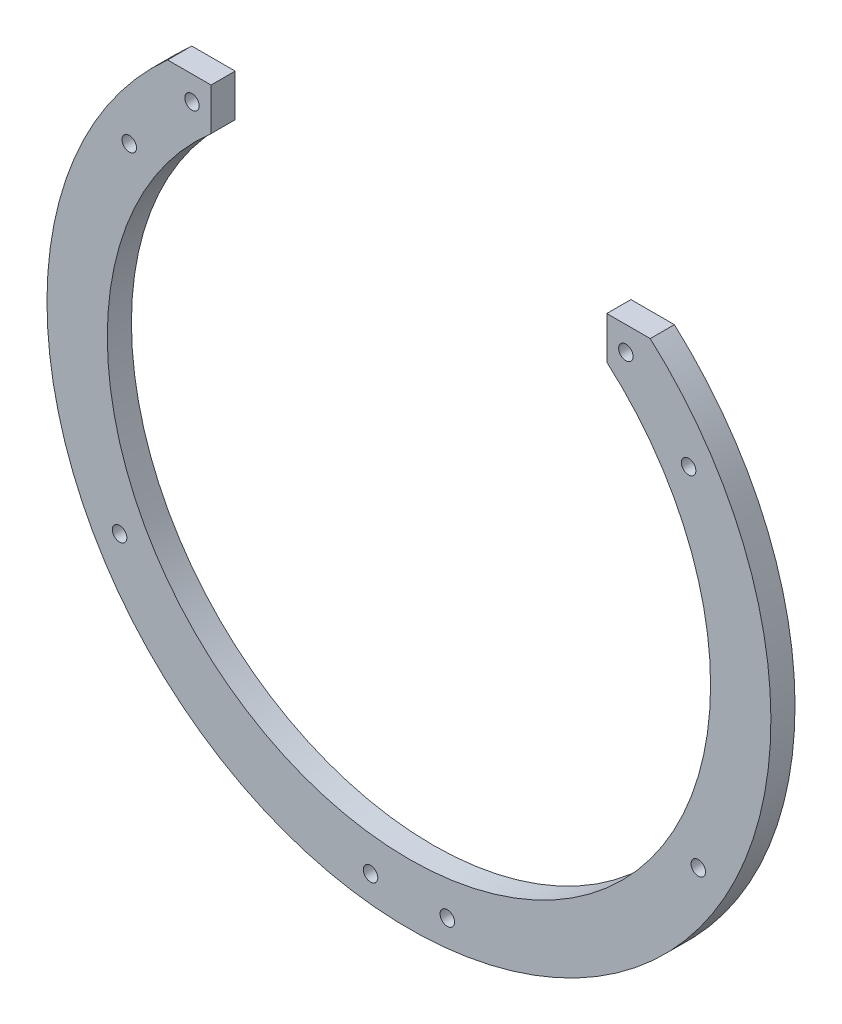
ISO-10303-21;
HEADER;
FILE_DESCRIPTION(('STEP AP214'),'2;1');
FILE_NAME('part.step','',(''),(''),'','','');
FILE_SCHEMA(('AUTOMOTIVE_DESIGN { 1 0 10303 214 1 1 1 1 }'));
ENDSEC;
DATA;
#1=APPLICATION_CONTEXT('core data for automotive mechanical design processes');
#2=APPLICATION_PROTOCOL_DEFINITION('international standard','automotive_design',2000,#1);
#3=PRODUCT_CONTEXT('',#1,'mechanical');
#4=PRODUCT('Part','Part','',(#3));
#5=PRODUCT_RELATED_PRODUCT_CATEGORY('part','',(#4));
#6=PRODUCT_DEFINITION_FORMATION('','',#4);
#7=PRODUCT_DEFINITION_CONTEXT('part definition',#1,'design');
#8=PRODUCT_DEFINITION('design','',#6,#7);
#9=PRODUCT_DEFINITION_SHAPE('','',#8);
#10=(LENGTH_UNIT() NAMED_UNIT(*) SI_UNIT(.MILLI.,.METRE.));
#11=(NAMED_UNIT(*) PLANE_ANGLE_UNIT() SI_UNIT($,.RADIAN.));
#12=(NAMED_UNIT(*) SI_UNIT($,.STERADIAN.) SOLID_ANGLE_UNIT());
#13=UNCERTAINTY_MEASURE_WITH_UNIT(LENGTH_MEASURE(1.E-05),#10,'distance_accuracy_value','');
#14=(GEOMETRIC_REPRESENTATION_CONTEXT(3) GLOBAL_UNCERTAINTY_ASSIGNED_CONTEXT((#13)) GLOBAL_UNIT_ASSIGNED_CONTEXT((#10,
#11,#12)) REPRESENTATION_CONTEXT('',''));
#15=CARTESIAN_POINT('',(0.,0.,0.));
#16=DIRECTION('',(0.,0.,1.));
#17=DIRECTION('',(1.,0.,0.));
#18=AXIS2_PLACEMENT_3D('',#15,#16,#17);
#19=CARTESIAN_POINT('',(-5.50459453888519,-224.332190762557,5.));
#20=DIRECTION('',(0.,0.,-1.));
#21=DIRECTION('',(-1.,0.,0.));
#22=AXIS2_PLACEMENT_3D('',#19,#20,#21);
#23=CYLINDRICAL_SURFACE('',#22,62.5);
#24=DIRECTION('',(0.,0.,-1.));
#25=VECTOR('',#24,1.);
#26=CARTESIAN_POINT('',(35.4954054611148,-177.159635182008,5.));
#27=LINE('',#26,#25);
#28=CARTESIAN_POINT('',(35.4954054611148,-177.159635182008,0.));
#29=VERTEX_POINT('',#28);
#30=CARTESIAN_POINT('',(35.4954054611148,-177.159635182008,5.));
#31=VERTEX_POINT('',#30);
#32=EDGE_CURVE('E137',#29,#31,#27,.F.);
#33=ORIENTED_EDGE('',*,*,#32,.F.);
#34=CARTESIAN_POINT('',(-5.50459453888519,-224.332190762557,0.));
#35=DIRECTION('',(0.,0.,1.));
#36=DIRECTION('',(1.,0.,0.));
#37=AXIS2_PLACEMENT_3D('',#34,#35,#36);
#38=CIRCLE('',#37,62.5);
#39=CARTESIAN_POINT('',(-46.5045945388852,-177.159635182008,0.));
#40=VERTEX_POINT('',#39);
#41=EDGE_CURVE('E119',#40,#29,#38,.T.);
#42=ORIENTED_EDGE('',*,*,#41,.F.);
#43=DIRECTION('',(0.,0.,-1.));
#44=VECTOR('',#43,1.);
#45=CARTESIAN_POINT('',(-46.5045945388852,-177.159635182008,5.));
#46=LINE('',#45,#44);
#47=CARTESIAN_POINT('',(-46.5045945388852,-177.159635182008,5.));
#48=VERTEX_POINT('',#47);
#49=EDGE_CURVE('E57',#48,#40,#46,.T.);
#50=ORIENTED_EDGE('',*,*,#49,.F.);
#51=CARTESIAN_POINT('',(-5.50459453888519,-224.332190762557,5.));
#52=DIRECTION('',(0.,0.,1.));
#53=DIRECTION('',(1.,0.,0.));
#54=AXIS2_PLACEMENT_3D('',#51,#52,#53);
#55=CIRCLE('',#54,62.5);
#56=EDGE_CURVE('E101',#48,#31,#55,.T.);
#57=ORIENTED_EDGE('',*,*,#56,.T.);
#58=EDGE_LOOP('',(#33,#42,#50,#57));
#59=FACE_BOUND('',#58,.T.);
#60=ADVANCED_FACE('F36',(#59),#23,.F.);
#61=CARTESIAN_POINT('',(0.,-168.430491325062,5.));
#62=DIRECTION('',(0.,-1.,0.));
#63=DIRECTION('',(0.,0.,-1.));
#64=AXIS2_PLACEMENT_3D('',#61,#62,#63);
#65=PLANE('',#64);
#66=DIRECTION('',(-1.,0.,0.));
#67=VECTOR('',#66,1.);
#68=CARTESIAN_POINT('',(0.,-168.430491325062,5.));
#69=LINE('',#68,#67);
#70=CARTESIAN_POINT('',(-46.5045945388852,-168.430491325062,5.));
#71=VERTEX_POINT('',#70);
#72=CARTESIAN_POINT('',(-55.5045945388852,-168.430491325062,5.));
#73=VERTEX_POINT('',#72);
#74=EDGE_CURVE('E98',#71,#73,#69,.T.);
#75=ORIENTED_EDGE('',*,*,#74,.F.);
#76=DIRECTION('',(0.,0.,-1.));
#77=VECTOR('',#76,1.);
#78=CARTESIAN_POINT('',(-46.5045945388852,-168.430491325062,5.));
#79=LINE('',#78,#77);
#80=CARTESIAN_POINT('',(-46.5045945388852,-168.430491325062,0.));
#81=VERTEX_POINT('',#80);
#82=EDGE_CURVE('E85',#71,#81,#79,.T.);
#83=ORIENTED_EDGE('',*,*,#82,.T.);
#84=DIRECTION('',(-1.,0.,0.));
#85=VECTOR('',#84,1.);
#86=CARTESIAN_POINT('',(0.,-168.430491325062,0.));
#87=LINE('',#86,#85);
#88=CARTESIAN_POINT('',(-55.5045945388852,-168.430491325062,0.));
#89=VERTEX_POINT('',#88);
#90=EDGE_CURVE('E122',#81,#89,#87,.T.);
#91=ORIENTED_EDGE('',*,*,#90,.T.);
#92=DIRECTION('',(0.,0.,-1.));
#93=VECTOR('',#92,1.);
#94=CARTESIAN_POINT('',(-55.5045945388852,-168.430491325062,5.));
#95=LINE('',#94,#93);
#96=EDGE_CURVE('E106',#73,#89,#95,.T.);
#97=ORIENTED_EDGE('',*,*,#96,.F.);
#98=EDGE_LOOP('',(#75,#83,#91,#97));
#99=FACE_BOUND('',#98,.T.);
#100=ADVANCED_FACE('F104',(#99),#65,.F.);
#101=CARTESIAN_POINT('',(-5.50459453888519,-224.332190762557,5.));
#102=DIRECTION('',(0.,0.,-1.));
#103=DIRECTION('',(-1.,0.,0.));
#104=AXIS2_PLACEMENT_3D('',#101,#102,#103);
#105=CYLINDRICAL_SURFACE('',#104,75.);
#106=CARTESIAN_POINT('',(-5.50459453888519,-224.332190762557,0.));
#107=DIRECTION('',(0.,0.,1.));
#108=DIRECTION('',(1.,0.,0.));
#109=AXIS2_PLACEMENT_3D('',#106,#107,#108);
#110=CIRCLE('',#109,75.);
#111=CARTESIAN_POINT('',(44.4954054611148,-168.430491325062,0.));
#112=VERTEX_POINT('',#111);
#113=EDGE_CURVE('E125',#89,#112,#110,.T.);
#114=ORIENTED_EDGE('',*,*,#113,.T.);
#115=DIRECTION('',(0.,0.,-1.));
#116=VECTOR('',#115,1.);
#117=CARTESIAN_POINT('',(44.4954054611148,-168.430491325062,5.));
#118=LINE('',#117,#116);
#119=CARTESIAN_POINT('',(44.4954054611148,-168.430491325062,5.));
#120=VERTEX_POINT('',#119);
#121=EDGE_CURVE('E118',#120,#112,#118,.T.);
#122=ORIENTED_EDGE('',*,*,#121,.F.);
#123=CARTESIAN_POINT('',(-5.50459453888519,-224.332190762557,5.));
#124=DIRECTION('',(0.,0.,1.));
#125=DIRECTION('',(1.,0.,0.));
#126=AXIS2_PLACEMENT_3D('',#123,#124,#125);
#127=CIRCLE('',#126,75.);
#128=EDGE_CURVE('E108',#73,#120,#127,.T.);
#129=ORIENTED_EDGE('',*,*,#128,.F.);
#130=ORIENTED_EDGE('',*,*,#96,.T.);
#131=EDGE_LOOP('',(#114,#122,#129,#130));
#132=FACE_BOUND('',#131,.T.);
#133=ADVANCED_FACE('F200',(#132),#105,.T.);
#134=CARTESIAN_POINT('',(0.,-168.430491325062,5.));
#135=DIRECTION('',(0.,-1.,0.));
#136=DIRECTION('',(0.,0.,-1.));
#137=AXIS2_PLACEMENT_3D('',#134,#135,#136);
#138=PLANE('',#137);
#139=DIRECTION('',(-1.,0.,0.));
#140=VECTOR('',#139,1.);
#141=CARTESIAN_POINT('',(0.,-168.430491325062,0.));
#142=LINE('',#141,#140);
#143=CARTESIAN_POINT('',(35.4954054611148,-168.430491325062,0.));
#144=VERTEX_POINT('',#143);
#145=EDGE_CURVE('E112',#112,#144,#142,.T.);
#146=ORIENTED_EDGE('',*,*,#145,.T.);
#147=DIRECTION('',(0.,0.,1.));
#148=VECTOR('',#147,1.);
#149=CARTESIAN_POINT('',(35.4954054611148,-168.430491325062,5.));
#150=LINE('',#149,#148);
#151=CARTESIAN_POINT('',(35.4954054611148,-168.430491325062,5.));
#152=VERTEX_POINT('',#151);
#153=EDGE_CURVE('E50',#144,#152,#150,.T.);
#154=ORIENTED_EDGE('',*,*,#153,.T.);
#155=DIRECTION('',(-1.,0.,0.));
#156=VECTOR('',#155,1.);
#157=CARTESIAN_POINT('',(0.,-168.430491325062,5.));
#158=LINE('',#157,#156);
#159=EDGE_CURVE('E110',#120,#152,#158,.T.);
#160=ORIENTED_EDGE('',*,*,#159,.F.);
#161=ORIENTED_EDGE('',*,*,#121,.T.);
#162=EDGE_LOOP('',(#146,#154,#160,#161));
#163=FACE_BOUND('',#162,.T.);
#164=ADVANCED_FACE('F192',(#163),#138,.F.);
#165=CARTESIAN_POINT('',(0.,0.,5.));
#166=DIRECTION('',(0.,0.,1.));
#167=DIRECTION('',(1.,0.,0.));
#168=AXIS2_PLACEMENT_3D('',#165,#166,#167);
#169=PLANE('',#168);
#170=DIRECTION('',(0.,1.,0.));
#171=VECTOR('',#170,1.);
#172=CARTESIAN_POINT('',(35.4954054611148,-179.941391977075,5.));
#173=LINE('',#172,#171);
#174=EDGE_CURVE('E102',#31,#152,#173,.T.);
#175=ORIENTED_EDGE('',*,*,#174,.F.);
#176=ORIENTED_EDGE('',*,*,#56,.F.);
#177=DIRECTION('',(0.,-1.,0.));
#178=VECTOR('',#177,1.);
#179=CARTESIAN_POINT('',(-46.5045945388852,-179.941391977075,5.));
#180=LINE('',#179,#178);
#181=EDGE_CURVE('E88',#71,#48,#180,.T.);
#182=ORIENTED_EDGE('',*,*,#181,.F.);
#183=ORIENTED_EDGE('',*,*,#74,.T.);
#184=ORIENTED_EDGE('',*,*,#128,.T.);
#185=ORIENTED_EDGE('',*,*,#159,.T.);
#186=EDGE_LOOP('',(#175,#176,#182,#183,#184,#185));
#187=FACE_BOUND('',#186,.T.);
#188=CARTESIAN_POINT('',(-50.4554442576325,-173.430491325062,5.));
#189=DIRECTION('',(0.,0.,1.));
#190=DIRECTION('',(-1.,0.,0.));
#191=AXIS2_PLACEMENT_3D('',#188,#189,#190);
#192=CIRCLE('',#191,1.5);
#193=CARTESIAN_POINT('',(-51.9554442576325,-173.430491325062,5.));
#194=VERTEX_POINT('',#193);
#195=EDGE_CURVE('E138',#194,#194,#192,.T.);
#196=ORIENTED_EDGE('',*,*,#195,.F.);
#197=EDGE_LOOP('',(#196));
#198=FACE_BOUND('',#197,.T.);
#199=CARTESIAN_POINT('',(-63.4554442576325,-187.430491325062,5.));
#200=DIRECTION('',(0.,0.,1.));
#201=DIRECTION('',(-1.,0.,0.));
#202=AXIS2_PLACEMENT_3D('',#199,#200,#201);
#203=CIRCLE('',#202,1.50000000000001);
#204=CARTESIAN_POINT('',(-64.9554442576325,-187.430491325062,5.));
#205=VERTEX_POINT('',#204);
#206=EDGE_CURVE('E162',#205,#205,#203,.T.);
#207=ORIENTED_EDGE('',*,*,#206,.F.);
#208=EDGE_LOOP('',(#207));
#209=FACE_BOUND('',#208,.T.);
#210=CARTESIAN_POINT('',(-65.4554442576326,-258.430491325062,5.));
#211=DIRECTION('',(0.,0.,1.));
#212=DIRECTION('',(-1.,0.,0.));
#213=AXIS2_PLACEMENT_3D('',#210,#211,#212);
#214=CIRCLE('',#213,1.50000000000001);
#215=CARTESIAN_POINT('',(-66.9554442576326,-258.430491325062,5.));
#216=VERTEX_POINT('',#215);
#217=EDGE_CURVE('E156',#216,#216,#214,.T.);
#218=ORIENTED_EDGE('',*,*,#217,.F.);
#219=EDGE_LOOP('',(#218));
#220=FACE_BOUND('',#219,.T.);
#221=CARTESIAN_POINT('',(2.4462551798622,-293.430491325062,5.));
#222=DIRECTION('',(0.,0.,1.));
#223=DIRECTION('',(1.,0.,0.));
#224=AXIS2_PLACEMENT_3D('',#221,#222,#223);
#225=CIRCLE('',#224,1.5);
#226=CARTESIAN_POINT('',(3.9462551798622,-293.430491325062,5.));
#227=VERTEX_POINT('',#226);
#228=EDGE_CURVE('E150',#227,#227,#225,.T.);
#229=ORIENTED_EDGE('',*,*,#228,.F.);
#230=EDGE_LOOP('',(#229));
#231=FACE_BOUND('',#230,.T.);
#232=CARTESIAN_POINT('',(-13.4554442576326,-293.430491325062,5.));
#233=DIRECTION('',(0.,0.,1.));
#234=DIRECTION('',(-1.,0.,0.));
#235=AXIS2_PLACEMENT_3D('',#232,#233,#234);
#236=CIRCLE('',#235,1.5);
#237=CARTESIAN_POINT('',(-14.9554442576326,-293.430491325062,5.));
#238=VERTEX_POINT('',#237);
#239=EDGE_CURVE('E149',#238,#238,#236,.T.);
#240=ORIENTED_EDGE('',*,*,#239,.F.);
#241=EDGE_LOOP('',(#240));
#242=FACE_BOUND('',#241,.T.);
#243=CARTESIAN_POINT('',(54.4462551798622,-258.430491325062,5.));
#244=DIRECTION('',(0.,0.,1.));
#245=DIRECTION('',(1.,0.,0.));
#246=AXIS2_PLACEMENT_3D('',#243,#244,#245);
#247=CIRCLE('',#246,1.5);
#248=CARTESIAN_POINT('',(55.9462551798622,-258.430491325062,5.));
#249=VERTEX_POINT('',#248);
#250=EDGE_CURVE('E177',#249,#249,#247,.T.);
#251=ORIENTED_EDGE('',*,*,#250,.F.);
#252=EDGE_LOOP('',(#251));
#253=FACE_BOUND('',#252,.T.);
#254=CARTESIAN_POINT('',(52.4462551798622,-187.430491325062,5.));
#255=DIRECTION('',(0.,0.,1.));
#256=DIRECTION('',(1.,0.,0.));
#257=AXIS2_PLACEMENT_3D('',#254,#255,#256);
#258=CIRCLE('',#257,1.5);
#259=CARTESIAN_POINT('',(53.9462551798622,-187.430491325062,5.));
#260=VERTEX_POINT('',#259);
#261=EDGE_CURVE('E171',#260,#260,#258,.T.);
#262=ORIENTED_EDGE('',*,*,#261,.F.);
#263=EDGE_LOOP('',(#262));
#264=FACE_BOUND('',#263,.T.);
#265=CARTESIAN_POINT('',(39.4462551798622,-173.430491325062,5.));
#266=DIRECTION('',(0.,0.,1.));
#267=DIRECTION('',(1.,0.,0.));
#268=AXIS2_PLACEMENT_3D('',#265,#266,#267);
#269=CIRCLE('',#268,1.5);
#270=CARTESIAN_POINT('',(40.9462551798622,-173.430491325062,5.));
#271=VERTEX_POINT('',#270);
#272=EDGE_CURVE('E170',#271,#271,#269,.T.);
#273=ORIENTED_EDGE('',*,*,#272,.F.);
#274=EDGE_LOOP('',(#273));
#275=FACE_BOUND('',#274,.T.);
#276=ADVANCED_FACE('F96',(#187,#198,#209,#220,#231,#242,#253,#264,#275),#169,.T.);
#277=CARTESIAN_POINT('',(0.,0.,0.));
#278=DIRECTION('',(0.,0.,1.));
#279=DIRECTION('',(1.,0.,0.));
#280=AXIS2_PLACEMENT_3D('',#277,#278,#279);
#281=PLANE('',#280);
#282=CARTESIAN_POINT('',(-50.4554442576325,-173.430491325062,0.));
#283=DIRECTION('',(0.,0.,1.));
#284=DIRECTION('',(-1.,0.,0.));
#285=AXIS2_PLACEMENT_3D('',#282,#283,#284);
#286=CIRCLE('',#285,1.5);
#287=CARTESIAN_POINT('',(-51.9554442576325,-173.430491325062,0.));
#288=VERTEX_POINT('',#287);
#289=EDGE_CURVE('E141',#288,#288,#286,.T.);
#290=ORIENTED_EDGE('',*,*,#289,.T.);
#291=EDGE_LOOP('',(#290));
#292=FACE_BOUND('',#291,.T.);
#293=CARTESIAN_POINT('',(-63.4554442576325,-187.430491325062,0.));
#294=DIRECTION('',(0.,0.,1.));
#295=DIRECTION('',(-1.,0.,0.));
#296=AXIS2_PLACEMENT_3D('',#293,#294,#295);
#297=CIRCLE('',#296,1.50000000000001);
#298=CARTESIAN_POINT('',(-64.9554442576325,-187.430491325062,0.));
#299=VERTEX_POINT('',#298);
#300=EDGE_CURVE('E159',#299,#299,#297,.T.);
#301=ORIENTED_EDGE('',*,*,#300,.T.);
#302=EDGE_LOOP('',(#301));
#303=FACE_BOUND('',#302,.T.);
#304=CARTESIAN_POINT('',(-65.4554442576326,-258.430491325062,0.));
#305=DIRECTION('',(0.,0.,1.));
#306=DIRECTION('',(-1.,0.,0.));
#307=AXIS2_PLACEMENT_3D('',#304,#305,#306);
#308=CIRCLE('',#307,1.50000000000001);
#309=CARTESIAN_POINT('',(-66.9554442576326,-258.430491325062,0.));
#310=VERTEX_POINT('',#309);
#311=EDGE_CURVE('E153',#310,#310,#308,.T.);
#312=ORIENTED_EDGE('',*,*,#311,.T.);
#313=EDGE_LOOP('',(#312));
#314=FACE_BOUND('',#313,.T.);
#315=CARTESIAN_POINT('',(2.4462551798622,-293.430491325062,0.));
#316=DIRECTION('',(0.,0.,1.));
#317=DIRECTION('',(1.,0.,0.));
#318=AXIS2_PLACEMENT_3D('',#315,#316,#317);
#319=CIRCLE('',#318,1.5);
#320=CARTESIAN_POINT('',(3.9462551798622,-293.430491325062,0.));
#321=VERTEX_POINT('',#320);
#322=EDGE_CURVE('E146',#321,#321,#319,.T.);
#323=ORIENTED_EDGE('',*,*,#322,.T.);
#324=EDGE_LOOP('',(#323));
#325=FACE_BOUND('',#324,.T.);
#326=CARTESIAN_POINT('',(-13.4554442576326,-293.430491325062,0.));
#327=DIRECTION('',(0.,0.,1.));
#328=DIRECTION('',(-1.,0.,0.));
#329=AXIS2_PLACEMENT_3D('',#326,#327,#328);
#330=CIRCLE('',#329,1.5);
#331=CARTESIAN_POINT('',(-14.9554442576326,-293.430491325062,0.));
#332=VERTEX_POINT('',#331);
#333=EDGE_CURVE('E180',#332,#332,#330,.T.);
#334=ORIENTED_EDGE('',*,*,#333,.T.);
#335=EDGE_LOOP('',(#334));
#336=FACE_BOUND('',#335,.T.);
#337=CARTESIAN_POINT('',(54.4462551798622,-258.430491325062,0.));
#338=DIRECTION('',(0.,0.,1.));
#339=DIRECTION('',(1.,0.,0.));
#340=AXIS2_PLACEMENT_3D('',#337,#338,#339);
#341=CIRCLE('',#340,1.5);
#342=CARTESIAN_POINT('',(55.9462551798622,-258.430491325062,0.));
#343=VERTEX_POINT('',#342);
#344=EDGE_CURVE('E174',#343,#343,#341,.T.);
#345=ORIENTED_EDGE('',*,*,#344,.T.);
#346=EDGE_LOOP('',(#345));
#347=FACE_BOUND('',#346,.T.);
#348=CARTESIAN_POINT('',(52.4462551798622,-187.430491325062,0.));
#349=DIRECTION('',(0.,0.,1.));
#350=DIRECTION('',(1.,0.,0.));
#351=AXIS2_PLACEMENT_3D('',#348,#349,#350);
#352=CIRCLE('',#351,1.5);
#353=CARTESIAN_POINT('',(53.9462551798622,-187.430491325062,0.));
#354=VERTEX_POINT('',#353);
#355=EDGE_CURVE('E167',#354,#354,#352,.T.);
#356=ORIENTED_EDGE('',*,*,#355,.T.);
#357=EDGE_LOOP('',(#356));
#358=FACE_BOUND('',#357,.T.);
#359=CARTESIAN_POINT('',(39.4462551798622,-173.430491325062,0.));
#360=DIRECTION('',(0.,0.,1.));
#361=DIRECTION('',(1.,0.,0.));
#362=AXIS2_PLACEMENT_3D('',#359,#360,#361);
#363=CIRCLE('',#362,1.5);
#364=CARTESIAN_POINT('',(40.9462551798622,-173.430491325062,0.));
#365=VERTEX_POINT('',#364);
#366=EDGE_CURVE('E123',#365,#365,#363,.T.);
#367=ORIENTED_EDGE('',*,*,#366,.T.);
#368=EDGE_LOOP('',(#367));
#369=FACE_BOUND('',#368,.T.);
#370=ORIENTED_EDGE('',*,*,#41,.T.);
#371=DIRECTION('',(0.,1.,0.));
#372=VECTOR('',#371,1.);
#373=CARTESIAN_POINT('',(35.4954054611148,0.,0.));
#374=LINE('',#373,#372);
#375=EDGE_CURVE('E11',#29,#144,#374,.T.);
#376=ORIENTED_EDGE('',*,*,#375,.T.);
#377=ORIENTED_EDGE('',*,*,#145,.F.);
#378=ORIENTED_EDGE('',*,*,#113,.F.);
#379=ORIENTED_EDGE('',*,*,#90,.F.);
#380=DIRECTION('',(0.,-1.,0.));
#381=VECTOR('',#380,1.);
#382=CARTESIAN_POINT('',(-46.5045945388852,0.,0.));
#383=LINE('',#382,#381);
#384=EDGE_CURVE('E43',#81,#40,#383,.T.);
#385=ORIENTED_EDGE('',*,*,#384,.T.);
#386=EDGE_LOOP('',(#370,#376,#377,#378,#379,#385));
#387=FACE_BOUND('',#386,.T.);
#388=ADVANCED_FACE('F133',(#292,#303,#314,#325,#336,#347,#358,#369,#387),#281,.F.);
#389=CARTESIAN_POINT('',(39.4462551798622,-173.430491325062,0.));
#390=DIRECTION('',(0.,0.,1.));
#391=DIRECTION('',(1.,0.,0.));
#392=AXIS2_PLACEMENT_3D('',#389,#390,#391);
#393=CYLINDRICAL_SURFACE('',#392,1.5);
#394=ORIENTED_EDGE('',*,*,#366,.F.);
#395=EDGE_LOOP('',(#394));
#396=FACE_BOUND('',#395,.T.);
#397=ORIENTED_EDGE('',*,*,#272,.T.);
#398=EDGE_LOOP('',(#397));
#399=FACE_BOUND('',#398,.T.);
#400=ADVANCED_FACE('F189',(#396,#399),#393,.F.);
#401=CARTESIAN_POINT('',(52.4462551798622,-187.430491325062,0.));
#402=DIRECTION('',(0.,0.,1.));
#403=DIRECTION('',(1.,0.,0.));
#404=AXIS2_PLACEMENT_3D('',#401,#402,#403);
#405=CYLINDRICAL_SURFACE('',#404,1.5);
#406=ORIENTED_EDGE('',*,*,#355,.F.);
#407=EDGE_LOOP('',(#406));
#408=FACE_BOUND('',#407,.T.);
#409=ORIENTED_EDGE('',*,*,#261,.T.);
#410=EDGE_LOOP('',(#409));
#411=FACE_BOUND('',#410,.T.);
#412=ADVANCED_FACE('F243',(#408,#411),#405,.F.);
#413=CARTESIAN_POINT('',(54.4462551798622,-258.430491325062,0.));
#414=DIRECTION('',(0.,0.,1.));
#415=DIRECTION('',(1.,0.,0.));
#416=AXIS2_PLACEMENT_3D('',#413,#414,#415);
#417=CYLINDRICAL_SURFACE('',#416,1.5);
#418=ORIENTED_EDGE('',*,*,#344,.F.);
#419=EDGE_LOOP('',(#418));
#420=FACE_BOUND('',#419,.T.);
#421=ORIENTED_EDGE('',*,*,#250,.T.);
#422=EDGE_LOOP('',(#421));
#423=FACE_BOUND('',#422,.T.);
#424=ADVANCED_FACE('F246',(#420,#423),#417,.F.);
#425=CARTESIAN_POINT('',(-13.4554442576326,-293.430491325062,0.));
#426=DIRECTION('',(0.,0.,1.));
#427=DIRECTION('',(1.,0.,0.));
#428=AXIS2_PLACEMENT_3D('',#425,#426,#427);
#429=CYLINDRICAL_SURFACE('',#428,1.5);
#430=ORIENTED_EDGE('',*,*,#333,.F.);
#431=EDGE_LOOP('',(#430));
#432=FACE_BOUND('',#431,.T.);
#433=ORIENTED_EDGE('',*,*,#239,.T.);
#434=EDGE_LOOP('',(#433));
#435=FACE_BOUND('',#434,.T.);
#436=ADVANCED_FACE('F231',(#432,#435),#429,.F.);
#437=CARTESIAN_POINT('',(2.4462551798622,-293.430491325062,0.));
#438=DIRECTION('',(0.,0.,1.));
#439=DIRECTION('',(1.,0.,0.));
#440=AXIS2_PLACEMENT_3D('',#437,#438,#439);
#441=CYLINDRICAL_SURFACE('',#440,1.5);
#442=ORIENTED_EDGE('',*,*,#322,.F.);
#443=EDGE_LOOP('',(#442));
#444=FACE_BOUND('',#443,.T.);
#445=ORIENTED_EDGE('',*,*,#228,.T.);
#446=EDGE_LOOP('',(#445));
#447=FACE_BOUND('',#446,.T.);
#448=ADVANCED_FACE('F227',(#444,#447),#441,.F.);
#449=CARTESIAN_POINT('',(-65.4554442576326,-258.430491325062,0.));
#450=DIRECTION('',(0.,0.,1.));
#451=DIRECTION('',(1.,0.,0.));
#452=AXIS2_PLACEMENT_3D('',#449,#450,#451);
#453=CYLINDRICAL_SURFACE('',#452,1.50000000000001);
#454=ORIENTED_EDGE('',*,*,#311,.F.);
#455=EDGE_LOOP('',(#454));
#456=FACE_BOUND('',#455,.T.);
#457=ORIENTED_EDGE('',*,*,#217,.T.);
#458=EDGE_LOOP('',(#457));
#459=FACE_BOUND('',#458,.T.);
#460=ADVANCED_FACE('F230',(#456,#459),#453,.F.);
#461=CARTESIAN_POINT('',(-63.4554442576325,-187.430491325062,0.));
#462=DIRECTION('',(0.,0.,1.));
#463=DIRECTION('',(1.,0.,0.));
#464=AXIS2_PLACEMENT_3D('',#461,#462,#463);
#465=CYLINDRICAL_SURFACE('',#464,1.50000000000001);
#466=ORIENTED_EDGE('',*,*,#300,.F.);
#467=EDGE_LOOP('',(#466));
#468=FACE_BOUND('',#467,.T.);
#469=ORIENTED_EDGE('',*,*,#206,.T.);
#470=EDGE_LOOP('',(#469));
#471=FACE_BOUND('',#470,.T.);
#472=ADVANCED_FACE('F235',(#468,#471),#465,.F.);
#473=CARTESIAN_POINT('',(-50.4554442576325,-173.430491325062,0.));
#474=DIRECTION('',(0.,0.,1.));
#475=DIRECTION('',(1.,0.,0.));
#476=AXIS2_PLACEMENT_3D('',#473,#474,#475);
#477=CYLINDRICAL_SURFACE('',#476,1.5);
#478=ORIENTED_EDGE('',*,*,#289,.F.);
#479=EDGE_LOOP('',(#478));
#480=FACE_BOUND('',#479,.T.);
#481=ORIENTED_EDGE('',*,*,#195,.T.);
#482=EDGE_LOOP('',(#481));
#483=FACE_BOUND('',#482,.T.);
#484=ADVANCED_FACE('F224',(#480,#483),#477,.F.);
#485=CARTESIAN_POINT('',(-46.5045945388852,-179.941391977075,-5.));
#486=DIRECTION('',(-1.,0.,0.));
#487=DIRECTION('',(0.,0.,1.));
#488=AXIS2_PLACEMENT_3D('',#485,#486,#487);
#489=PLANE('',#488);
#490=ORIENTED_EDGE('',*,*,#49,.T.);
#491=ORIENTED_EDGE('',*,*,#384,.F.);
#492=ORIENTED_EDGE('',*,*,#82,.F.);
#493=ORIENTED_EDGE('',*,*,#181,.T.);
#494=EDGE_LOOP('',(#490,#491,#492,#493));
#495=FACE_BOUND('',#494,.T.);
#496=ADVANCED_FACE('F87',(#495),#489,.F.);
#497=CARTESIAN_POINT('',(35.4954054611148,-179.941391977075,-5.));
#498=DIRECTION('',(1.,0.,0.));
#499=DIRECTION('',(0.,0.,-1.));
#500=AXIS2_PLACEMENT_3D('',#497,#498,#499);
#501=PLANE('',#500);
#502=ORIENTED_EDGE('',*,*,#32,.T.);
#503=ORIENTED_EDGE('',*,*,#174,.T.);
#504=ORIENTED_EDGE('',*,*,#153,.F.);
#505=ORIENTED_EDGE('',*,*,#375,.F.);
#506=EDGE_LOOP('',(#502,#503,#504,#505));
#507=FACE_BOUND('',#506,.T.);
#508=ADVANCED_FACE('F218',(#507),#501,.F.);
#509=CLOSED_SHELL('',(#60,#100,#133,#164,#276,#388,#400,#412,#424,#436,#448,#460,#472,#484,#496,#508));
#510=MANIFOLD_SOLID_BREP('B2',#509);
#511=ADVANCED_BREP_SHAPE_REPRESENTATION('',(#18,#510),#14);
#512=SHAPE_DEFINITION_REPRESENTATION(#9,#511);
ENDSEC;
END-ISO-10303-21;
